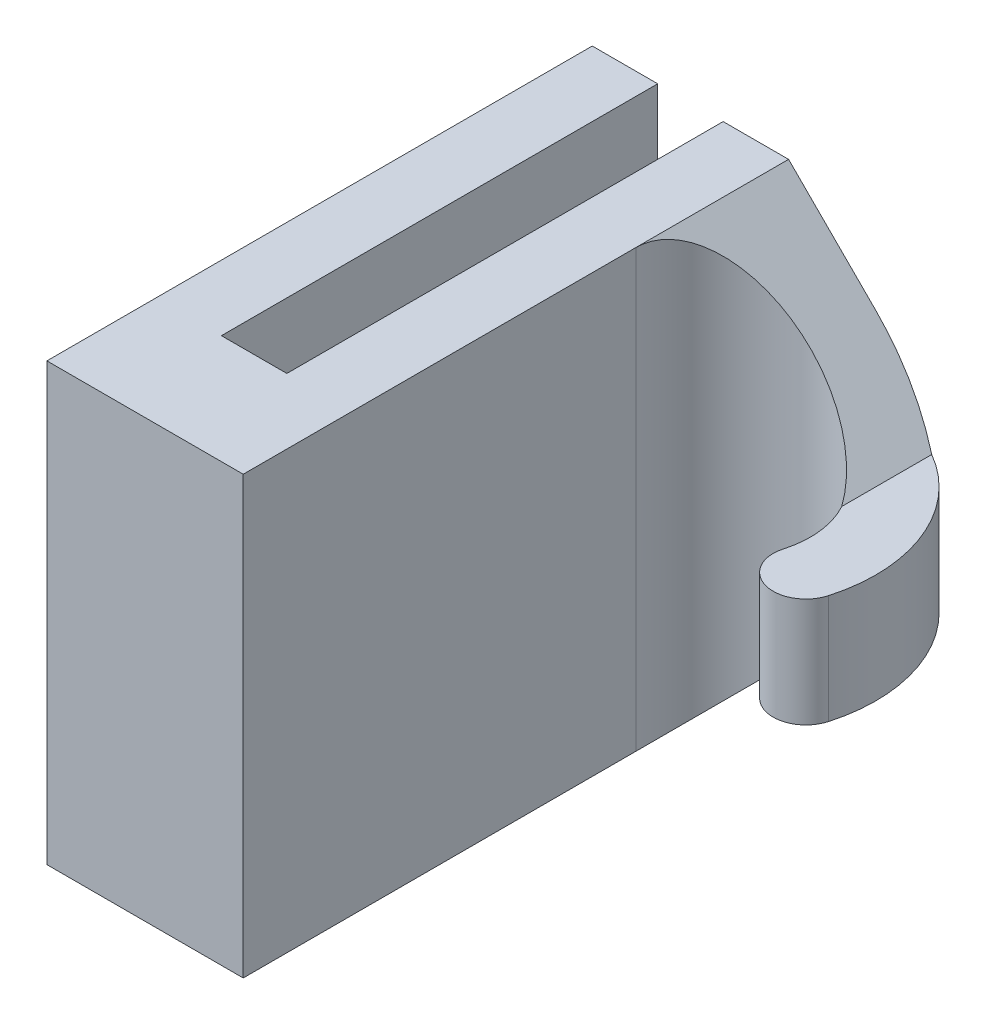
ISO-10303-21;
HEADER;
FILE_DESCRIPTION(('STEP AP214'),'2;1');
FILE_NAME('part.step','',(''),(''),'','','');
FILE_SCHEMA(('AUTOMOTIVE_DESIGN { 1 0 10303 214 1 1 1 1 }'));
ENDSEC;
DATA;
#1=APPLICATION_CONTEXT('core data for automotive mechanical design processes');
#2=APPLICATION_PROTOCOL_DEFINITION('international standard','automotive_design',2000,#1);
#3=PRODUCT_CONTEXT('',#1,'mechanical');
#4=PRODUCT('Part','Part','',(#3));
#5=PRODUCT_RELATED_PRODUCT_CATEGORY('part','',(#4));
#6=PRODUCT_DEFINITION_FORMATION('','',#4);
#7=PRODUCT_DEFINITION_CONTEXT('part definition',#1,'design');
#8=PRODUCT_DEFINITION('design','',#6,#7);
#9=PRODUCT_DEFINITION_SHAPE('','',#8);
#10=(LENGTH_UNIT() NAMED_UNIT(*) SI_UNIT(.MILLI.,.METRE.));
#11=(NAMED_UNIT(*) PLANE_ANGLE_UNIT() SI_UNIT($,.RADIAN.));
#12=(NAMED_UNIT(*) SI_UNIT($,.STERADIAN.) SOLID_ANGLE_UNIT());
#13=UNCERTAINTY_MEASURE_WITH_UNIT(LENGTH_MEASURE(1.E-05),#10,'distance_accuracy_value','');
#14=(GEOMETRIC_REPRESENTATION_CONTEXT(3) GLOBAL_UNCERTAINTY_ASSIGNED_CONTEXT((#13)) GLOBAL_UNIT_ASSIGNED_CONTEXT((#10,
#11,#12)) REPRESENTATION_CONTEXT('',''));
#15=CARTESIAN_POINT('',(0.,0.,0.));
#16=DIRECTION('',(0.,0.,1.));
#17=DIRECTION('',(1.,0.,0.));
#18=AXIS2_PLACEMENT_3D('',#15,#16,#17);
#19=CARTESIAN_POINT('',(0.,123.429339488827,115.));
#20=DIRECTION('',(-1.,0.,0.));
#21=DIRECTION('',(0.,0.,1.));
#22=AXIS2_PLACEMENT_3D('',#19,#20,#21);
#23=PLANE('',#22);
#24=DIRECTION('',(0.,0.,1.));
#25=VECTOR('',#24,1.);
#26=CARTESIAN_POINT('',(0.,150.,115.));
#27=LINE('',#26,#25);
#28=CARTESIAN_POINT('',(0.,150.,95.));
#29=VERTEX_POINT('',#28);
#30=CARTESIAN_POINT('',(0.,150.,115.));
#31=VERTEX_POINT('',#30);
#32=EDGE_CURVE('E231',#29,#31,#27,.T.);
#33=ORIENTED_EDGE('',*,*,#32,.F.);
#34=DIRECTION('',(0.,1.,0.));
#35=VECTOR('',#34,1.);
#36=CARTESIAN_POINT('',(0.,123.429339488827,95.));
#37=LINE('',#36,#35);
#38=CARTESIAN_POINT('',(0.,170.,95.));
#39=VERTEX_POINT('',#38);
#40=EDGE_CURVE('E181',#29,#39,#37,.T.);
#41=ORIENTED_EDGE('',*,*,#40,.T.);
#42=DIRECTION('',(0.,0.,1.));
#43=VECTOR('',#42,1.);
#44=CARTESIAN_POINT('',(0.,170.,115.));
#45=LINE('',#44,#43);
#46=CARTESIAN_POINT('',(0.,170.,115.));
#47=VERTEX_POINT('',#46);
#48=EDGE_CURVE('E215',#39,#47,#45,.T.);
#49=ORIENTED_EDGE('',*,*,#48,.T.);
#50=DIRECTION('',(0.,1.,0.));
#51=VECTOR('',#50,1.);
#52=CARTESIAN_POINT('',(0.,123.429339488827,115.));
#53=LINE('',#52,#51);
#54=EDGE_CURVE('E211',#31,#47,#53,.T.);
#55=ORIENTED_EDGE('',*,*,#54,.F.);
#56=EDGE_LOOP('',(#33,#41,#49,#55));
#57=FACE_BOUND('',#56,.T.);
#58=ADVANCED_FACE('F47',(#57),#23,.F.);
#59=CARTESIAN_POINT('',(3.,123.429339488827,115.));
#60=DIRECTION('',(0.,0.,1.));
#61=DIRECTION('',(1.,0.,0.));
#62=AXIS2_PLACEMENT_3D('',#59,#60,#61);
#63=PLANE('',#62);
#64=DIRECTION('',(1.,0.,0.));
#65=VECTOR('',#64,1.);
#66=CARTESIAN_POINT('',(3.00000000000025,150.,115.));
#67=LINE('',#66,#65);
#68=CARTESIAN_POINT('',(3.,150.,115.));
#69=VERTEX_POINT('',#68);
#70=EDGE_CURVE('E235',#31,#69,#67,.T.);
#71=ORIENTED_EDGE('',*,*,#70,.F.);
#72=ORIENTED_EDGE('',*,*,#54,.T.);
#73=DIRECTION('',(1.,0.,0.));
#74=VECTOR('',#73,1.);
#75=CARTESIAN_POINT('',(3.,170.,115.));
#76=LINE('',#75,#74);
#77=CARTESIAN_POINT('',(3.,170.,115.));
#78=VERTEX_POINT('',#77);
#79=EDGE_CURVE('E208',#47,#78,#76,.T.);
#80=ORIENTED_EDGE('',*,*,#79,.T.);
#81=DIRECTION('',(0.,1.,0.));
#82=VECTOR('',#81,1.);
#83=CARTESIAN_POINT('',(3.,123.429339488827,115.));
#84=LINE('',#83,#82);
#85=EDGE_CURVE('E210',#69,#78,#84,.T.);
#86=ORIENTED_EDGE('',*,*,#85,.F.);
#87=EDGE_LOOP('',(#71,#72,#80,#86));
#88=FACE_BOUND('',#87,.T.);
#89=ADVANCED_FACE('F271',(#88),#63,.F.);
#90=CARTESIAN_POINT('',(3.,123.429339488827,95.));
#91=DIRECTION('',(1.,0.,0.));
#92=DIRECTION('',(0.,0.,-1.));
#93=AXIS2_PLACEMENT_3D('',#90,#91,#92);
#94=PLANE('',#93);
#95=DIRECTION('',(0.,0.,-1.));
#96=VECTOR('',#95,1.);
#97=CARTESIAN_POINT('',(3.,170.,95.));
#98=LINE('',#97,#96);
#99=CARTESIAN_POINT('',(3.,170.,95.));
#100=VERTEX_POINT('',#99);
#101=EDGE_CURVE('E204',#78,#100,#98,.T.);
#102=ORIENTED_EDGE('',*,*,#101,.T.);
#103=DIRECTION('',(0.,1.,0.));
#104=VECTOR('',#103,1.);
#105=CARTESIAN_POINT('',(3.,123.429339488827,95.));
#106=LINE('',#105,#104);
#107=CARTESIAN_POINT('',(3.,150.,95.));
#108=VERTEX_POINT('',#107);
#109=EDGE_CURVE('E201',#108,#100,#106,.T.);
#110=ORIENTED_EDGE('',*,*,#109,.F.);
#111=DIRECTION('',(0.,0.,-1.));
#112=VECTOR('',#111,1.);
#113=CARTESIAN_POINT('',(3.,150.,95.));
#114=LINE('',#113,#112);
#115=EDGE_CURVE('E226',#69,#108,#114,.T.);
#116=ORIENTED_EDGE('',*,*,#115,.F.);
#117=ORIENTED_EDGE('',*,*,#85,.T.);
#118=EDGE_LOOP('',(#102,#110,#116,#117));
#119=FACE_BOUND('',#118,.T.);
#120=ADVANCED_FACE('F267',(#119),#94,.F.);
#121=CARTESIAN_POINT('',(6.,123.429339488827,95.));
#122=DIRECTION('',(0.,0.,1.));
#123=DIRECTION('',(1.,0.,0.));
#124=AXIS2_PLACEMENT_3D('',#121,#122,#123);
#125=PLANE('',#124);
#126=ORIENTED_EDGE('',*,*,#109,.T.);
#127=DIRECTION('',(1.,0.,0.));
#128=VECTOR('',#127,1.);
#129=CARTESIAN_POINT('',(6.,170.,95.));
#130=LINE('',#129,#128);
#131=CARTESIAN_POINT('',(6.,170.,95.));
#132=VERTEX_POINT('',#131);
#133=EDGE_CURVE('E203',#100,#132,#130,.T.);
#134=ORIENTED_EDGE('',*,*,#133,.T.);
#135=DIRECTION('',(-0.707106781186552,0.707106781186543,0.));
#136=VECTOR('',#135,1.);
#137=CARTESIAN_POINT('',(29.2853302555864,146.714669744414,95.));
#138=LINE('',#137,#136);
#139=CARTESIAN_POINT('',(10.,166.,95.));
#140=VERTEX_POINT('',#139);
#141=EDGE_CURVE('E255',#132,#140,#138,.F.);
#142=ORIENTED_EDGE('',*,*,#141,.T.);
#143=DIRECTION('',(0.,1.,0.));
#144=VECTOR('',#143,1.);
#145=CARTESIAN_POINT('',(10.,157.5,95.));
#146=LINE('',#145,#144);
#147=CARTESIAN_POINT('',(10.,154.,95.));
#148=VERTEX_POINT('',#147);
#149=EDGE_CURVE('E61',#148,#140,#146,.T.);
#150=ORIENTED_EDGE('',*,*,#149,.F.);
#151=DIRECTION('',(-0.707106781186543,-0.707106781186552,0.));
#152=VECTOR('',#151,1.);
#153=CARTESIAN_POINT('',(-7.28533025558639,136.714669744413,95.));
#154=LINE('',#153,#152);
#155=CARTESIAN_POINT('',(6.,150.,95.));
#156=VERTEX_POINT('',#155);
#157=EDGE_CURVE('E11',#148,#156,#154,.T.);
#158=ORIENTED_EDGE('',*,*,#157,.T.);
#159=DIRECTION('',(1.,0.,0.));
#160=VECTOR('',#159,1.);
#161=CARTESIAN_POINT('',(6.00000000000025,150.,95.));
#162=LINE('',#161,#160);
#163=EDGE_CURVE('E227',#108,#156,#162,.T.);
#164=ORIENTED_EDGE('',*,*,#163,.F.);
#165=EDGE_LOOP('',(#126,#134,#142,#150,#158,#164));
#166=FACE_BOUND('',#165,.T.);
#167=ADVANCED_FACE('F263',(#166),#125,.F.);
#168=CARTESIAN_POINT('',(6.,123.429339488827,120.));
#169=DIRECTION('',(-1.,0.,0.));
#170=DIRECTION('',(0.,0.,1.));
#171=AXIS2_PLACEMENT_3D('',#168,#169,#170);
#172=PLANE('',#171);
#173=DIRECTION('',(0.,1.,0.));
#174=VECTOR('',#173,1.);
#175=CARTESIAN_POINT('',(6.,157.5,102.));
#176=LINE('',#175,#174);
#177=CARTESIAN_POINT('',(6.,150.,102.));
#178=VERTEX_POINT('',#177);
#179=CARTESIAN_POINT('',(6.,170.,102.));
#180=VERTEX_POINT('',#179);
#181=EDGE_CURVE('E175',#178,#180,#176,.T.);
#182=ORIENTED_EDGE('',*,*,#181,.T.);
#183=DIRECTION('',(0.,0.,1.));
#184=VECTOR('',#183,1.);
#185=CARTESIAN_POINT('',(6.,170.,120.));
#186=LINE('',#185,#184);
#187=CARTESIAN_POINT('',(6.,170.,120.));
#188=VERTEX_POINT('',#187);
#189=EDGE_CURVE('E199',#180,#188,#186,.T.);
#190=ORIENTED_EDGE('',*,*,#189,.T.);
#191=DIRECTION('',(0.,1.,0.));
#192=VECTOR('',#191,1.);
#193=CARTESIAN_POINT('',(6.,123.429339488827,120.));
#194=LINE('',#193,#192);
#195=CARTESIAN_POINT('',(6.,150.,120.));
#196=VERTEX_POINT('',#195);
#197=EDGE_CURVE('E198',#196,#188,#194,.T.);
#198=ORIENTED_EDGE('',*,*,#197,.F.);
#199=DIRECTION('',(0.,0.,1.));
#200=VECTOR('',#199,1.);
#201=CARTESIAN_POINT('',(6.,150.,120.));
#202=LINE('',#201,#200);
#203=EDGE_CURVE('E223',#178,#196,#202,.T.);
#204=ORIENTED_EDGE('',*,*,#203,.F.);
#205=EDGE_LOOP('',(#182,#190,#198,#204));
#206=FACE_BOUND('',#205,.T.);
#207=ADVANCED_FACE('F294',(#206),#172,.F.);
#208=CARTESIAN_POINT('',(-3.,123.429339488827,120.));
#209=DIRECTION('',(0.,0.,-1.));
#210=DIRECTION('',(-1.,0.,0.));
#211=AXIS2_PLACEMENT_3D('',#208,#209,#210);
#212=PLANE('',#211);
#213=DIRECTION('',(-1.,0.,0.));
#214=VECTOR('',#213,1.);
#215=CARTESIAN_POINT('',(-2.99999999999975,150.,120.));
#216=LINE('',#215,#214);
#217=CARTESIAN_POINT('',(-3.,150.,120.));
#218=VERTEX_POINT('',#217);
#219=EDGE_CURVE('E218',#196,#218,#216,.T.);
#220=ORIENTED_EDGE('',*,*,#219,.F.);
#221=ORIENTED_EDGE('',*,*,#197,.T.);
#222=DIRECTION('',(-1.,0.,0.));
#223=VECTOR('',#222,1.);
#224=CARTESIAN_POINT('',(-3.,170.,120.));
#225=LINE('',#224,#223);
#226=CARTESIAN_POINT('',(-3.,170.,120.));
#227=VERTEX_POINT('',#226);
#228=EDGE_CURVE('E193',#188,#227,#225,.T.);
#229=ORIENTED_EDGE('',*,*,#228,.T.);
#230=DIRECTION('',(0.,1.,0.));
#231=VECTOR('',#230,1.);
#232=CARTESIAN_POINT('',(-3.,123.429339488827,120.));
#233=LINE('',#232,#231);
#234=EDGE_CURVE('E195',#218,#227,#233,.T.);
#235=ORIENTED_EDGE('',*,*,#234,.F.);
#236=EDGE_LOOP('',(#220,#221,#229,#235));
#237=FACE_BOUND('',#236,.T.);
#238=ADVANCED_FACE('F299',(#237),#212,.F.);
#239=CARTESIAN_POINT('',(-3.,123.429339488827,95.));
#240=DIRECTION('',(1.,0.,0.));
#241=DIRECTION('',(0.,0.,-1.));
#242=AXIS2_PLACEMENT_3D('',#239,#240,#241);
#243=PLANE('',#242);
#244=DIRECTION('',(0.,0.,-1.));
#245=VECTOR('',#244,1.);
#246=CARTESIAN_POINT('',(-3.,150.,95.));
#247=LINE('',#246,#245);
#248=CARTESIAN_POINT('',(-3.,150.,95.));
#249=VERTEX_POINT('',#248);
#250=EDGE_CURVE('E214',#218,#249,#247,.T.);
#251=ORIENTED_EDGE('',*,*,#250,.F.);
#252=ORIENTED_EDGE('',*,*,#234,.T.);
#253=DIRECTION('',(0.,0.,-1.));
#254=VECTOR('',#253,1.);
#255=CARTESIAN_POINT('',(-3.,170.,95.));
#256=LINE('',#255,#254);
#257=CARTESIAN_POINT('',(-3.,170.,95.));
#258=VERTEX_POINT('',#257);
#259=EDGE_CURVE('E186',#227,#258,#256,.T.);
#260=ORIENTED_EDGE('',*,*,#259,.T.);
#261=DIRECTION('',(0.,1.,0.));
#262=VECTOR('',#261,1.);
#263=CARTESIAN_POINT('',(-3.,123.429339488827,95.));
#264=LINE('',#263,#262);
#265=EDGE_CURVE('E189',#249,#258,#264,.T.);
#266=ORIENTED_EDGE('',*,*,#265,.F.);
#267=EDGE_LOOP('',(#251,#252,#260,#266));
#268=FACE_BOUND('',#267,.T.);
#269=ADVANCED_FACE('F305',(#268),#243,.F.);
#270=CARTESIAN_POINT('',(0.,123.429339488827,95.));
#271=DIRECTION('',(0.,0.,1.));
#272=DIRECTION('',(1.,0.,0.));
#273=AXIS2_PLACEMENT_3D('',#270,#271,#272);
#274=PLANE('',#273);
#275=DIRECTION('',(1.,0.,0.));
#276=VECTOR('',#275,1.);
#277=CARTESIAN_POINT('',(2.45827992325021E-13,150.,95.));
#278=LINE('',#277,#276);
#279=EDGE_CURVE('E190',#249,#29,#278,.T.);
#280=ORIENTED_EDGE('',*,*,#279,.F.);
#281=ORIENTED_EDGE('',*,*,#265,.T.);
#282=DIRECTION('',(1.,0.,0.));
#283=VECTOR('',#282,1.);
#284=CARTESIAN_POINT('',(0.,170.,95.));
#285=LINE('',#284,#283);
#286=EDGE_CURVE('E184',#258,#39,#285,.T.);
#287=ORIENTED_EDGE('',*,*,#286,.T.);
#288=ORIENTED_EDGE('',*,*,#40,.F.);
#289=EDGE_LOOP('',(#280,#281,#287,#288));
#290=FACE_BOUND('',#289,.T.);
#291=ADVANCED_FACE('F307',(#290),#274,.F.);
#292=CARTESIAN_POINT('',(0.,170.,0.));
#293=DIRECTION('',(0.,1.,0.));
#294=DIRECTION('',(0.,0.,1.));
#295=AXIS2_PLACEMENT_3D('',#292,#293,#294);
#296=PLANE('',#295);
#297=ORIENTED_EDGE('',*,*,#48,.F.);
#298=ORIENTED_EDGE('',*,*,#286,.F.);
#299=ORIENTED_EDGE('',*,*,#259,.F.);
#300=ORIENTED_EDGE('',*,*,#228,.F.);
#301=ORIENTED_EDGE('',*,*,#189,.F.);
#302=EDGE_CURVE('E197',#132,#180,#186,.T.);
#303=ORIENTED_EDGE('',*,*,#302,.F.);
#304=ORIENTED_EDGE('',*,*,#133,.F.);
#305=ORIENTED_EDGE('',*,*,#101,.F.);
#306=ORIENTED_EDGE('',*,*,#79,.F.);
#307=EDGE_LOOP('',(#297,#298,#299,#300,#301,#303,#304,#305,#306));
#308=FACE_BOUND('',#307,.T.);
#309=ADVANCED_FACE('F279',(#308),#296,.T.);
#310=CARTESIAN_POINT('',(0.,150.,115.));
#311=DIRECTION('',(0.,-1.,0.));
#312=DIRECTION('',(1.,0.,0.));
#313=AXIS2_PLACEMENT_3D('',#310,#311,#312);
#314=PLANE('',#313);
#315=ORIENTED_EDGE('',*,*,#279,.T.);
#316=ORIENTED_EDGE('',*,*,#32,.T.);
#317=ORIENTED_EDGE('',*,*,#70,.T.);
#318=ORIENTED_EDGE('',*,*,#115,.T.);
#319=ORIENTED_EDGE('',*,*,#163,.T.);
#320=EDGE_CURVE('E225',#156,#178,#202,.T.);
#321=ORIENTED_EDGE('',*,*,#320,.T.);
#322=ORIENTED_EDGE('',*,*,#203,.T.);
#323=ORIENTED_EDGE('',*,*,#219,.T.);
#324=ORIENTED_EDGE('',*,*,#250,.T.);
#325=EDGE_LOOP('',(#315,#316,#317,#318,#319,#321,#322,#323,#324));
#326=FACE_BOUND('',#325,.T.);
#327=ADVANCED_FACE('F266',(#326),#314,.T.);
#328=CARTESIAN_POINT('',(10.,157.5,102.));
#329=DIRECTION('',(0.,-1.,0.));
#330=DIRECTION('',(0.,0.,-1.));
#331=AXIS2_PLACEMENT_3D('',#328,#329,#330);
#332=PLANE('',#331);
#333=CARTESIAN_POINT('',(10.,157.5,102.));
#334=DIRECTION('',(0.,1.,0.));
#335=DIRECTION('',(0.,0.,-1.));
#336=AXIS2_PLACEMENT_3D('',#333,#334,#335);
#337=CIRCLE('',#336,4.);
#338=CARTESIAN_POINT('',(13.8483655433667,157.5,103.090909090909));
#339=VERTEX_POINT('',#338);
#340=CARTESIAN_POINT('',(13.5,157.5,100.063508326896));
#341=VERTEX_POINT('',#340);
#342=EDGE_CURVE('E168',#339,#341,#337,.T.);
#343=ORIENTED_EDGE('',*,*,#342,.T.);
#344=DIRECTION('',(0.,0.,-1.));
#345=VECTOR('',#344,1.);
#346=CARTESIAN_POINT('',(13.5,157.5,102.));
#347=LINE('',#346,#345);
#348=CARTESIAN_POINT('',(13.5,157.5,95.9378221735089));
#349=VERTEX_POINT('',#348);
#350=EDGE_CURVE('E152',#341,#349,#347,.T.);
#351=ORIENTED_EDGE('',*,*,#350,.T.);
#352=CARTESIAN_POINT('',(10.,157.5,102.));
#353=DIRECTION('',(0.,-1.,0.));
#354=DIRECTION('',(0.,0.,-1.));
#355=AXIS2_PLACEMENT_3D('',#352,#353,#354);
#356=CIRCLE('',#355,6.99999999999999);
#357=CARTESIAN_POINT('',(16.7346397008917,157.5,103.909090909091));
#358=VERTEX_POINT('',#357);
#359=EDGE_CURVE('E148',#349,#358,#356,.T.);
#360=ORIENTED_EDGE('',*,*,#359,.T.);
#361=CARTESIAN_POINT('',(15.2915026221292,157.5,103.5));
#362=DIRECTION('',(0.,-1.,0.));
#363=DIRECTION('',(0.,0.,1.));
#364=AXIS2_PLACEMENT_3D('',#361,#362,#363);
#365=CIRCLE('',#364,1.5);
#366=EDGE_CURVE('E151',#358,#339,#365,.T.);
#367=ORIENTED_EDGE('',*,*,#366,.T.);
#368=EDGE_LOOP('',(#343,#351,#360,#367));
#369=FACE_BOUND('',#368,.T.);
#370=ADVANCED_FACE('F149',(#369),#332,.T.);
#371=CARTESIAN_POINT('',(10.,162.5,102.));
#372=DIRECTION('',(0.,-1.,0.));
#373=DIRECTION('',(0.,0.,-1.));
#374=AXIS2_PLACEMENT_3D('',#371,#372,#373);
#375=PLANE('',#374);
#376=CARTESIAN_POINT('',(10.,162.5,102.));
#377=DIRECTION('',(0.,-1.,0.));
#378=DIRECTION('',(0.,0.,-1.));
#379=AXIS2_PLACEMENT_3D('',#376,#377,#378);
#380=CIRCLE('',#379,6.99999999999999);
#381=CARTESIAN_POINT('',(13.5,162.5,95.937822173509));
#382=VERTEX_POINT('',#381);
#383=CARTESIAN_POINT('',(16.7346397008917,162.5,103.909090909091));
#384=VERTEX_POINT('',#383);
#385=EDGE_CURVE('E165',#382,#384,#380,.T.);
#386=ORIENTED_EDGE('',*,*,#385,.F.);
#387=DIRECTION('',(0.,0.,1.));
#388=VECTOR('',#387,1.);
#389=CARTESIAN_POINT('',(13.5,162.5,102.));
#390=LINE('',#389,#388);
#391=CARTESIAN_POINT('',(13.5,162.5,100.063508326896));
#392=VERTEX_POINT('',#391);
#393=EDGE_CURVE('E217',#382,#392,#390,.T.);
#394=ORIENTED_EDGE('',*,*,#393,.T.);
#395=CARTESIAN_POINT('',(10.,162.5,102.));
#396=DIRECTION('',(0.,1.,0.));
#397=DIRECTION('',(0.,0.,-1.));
#398=AXIS2_PLACEMENT_3D('',#395,#396,#397);
#399=CIRCLE('',#398,4.);
#400=CARTESIAN_POINT('',(13.8483655433667,162.5,103.090909090909));
#401=VERTEX_POINT('',#400);
#402=EDGE_CURVE('E156',#401,#392,#399,.T.);
#403=ORIENTED_EDGE('',*,*,#402,.F.);
#404=CARTESIAN_POINT('',(15.2915026221292,162.5,103.5));
#405=DIRECTION('',(0.,-1.,0.));
#406=DIRECTION('',(0.,0.,1.));
#407=AXIS2_PLACEMENT_3D('',#404,#405,#406);
#408=CIRCLE('',#407,1.5);
#409=EDGE_CURVE('E177',#384,#401,#408,.T.);
#410=ORIENTED_EDGE('',*,*,#409,.F.);
#411=EDGE_LOOP('',(#386,#394,#403,#410));
#412=FACE_BOUND('',#411,.T.);
#413=ADVANCED_FACE('F290',(#412),#375,.F.);
#414=CARTESIAN_POINT('',(10.,157.5,102.));
#415=DIRECTION('',(0.,1.,0.));
#416=DIRECTION('',(0.,0.,1.));
#417=AXIS2_PLACEMENT_3D('',#414,#415,#416);
#418=CYLINDRICAL_SURFACE('',#417,6.99999999999999);
#419=ORIENTED_EDGE('',*,*,#149,.T.);
#420=CARTESIAN_POINT('',(10.,166.,102.));
#421=DIRECTION('',(0.707106781186543,0.707106781186552,0.));
#422=DIRECTION('',(-0.707106781186552,0.707106781186543,0.));
#423=AXIS2_PLACEMENT_3D('',#420,#421,#422);
#424=ELLIPSE('',#423,9.8994949366116,6.99999999999999);
#425=EDGE_CURVE('E258',#140,#382,#424,.F.);
#426=ORIENTED_EDGE('',*,*,#425,.T.);
#427=ORIENTED_EDGE('',*,*,#385,.T.);
#428=DIRECTION('',(0.,1.,0.));
#429=VECTOR('',#428,1.);
#430=CARTESIAN_POINT('',(16.7346397008917,157.5,103.909090909091));
#431=LINE('',#430,#429);
#432=EDGE_CURVE('E157',#358,#384,#431,.T.);
#433=ORIENTED_EDGE('',*,*,#432,.F.);
#434=ORIENTED_EDGE('',*,*,#359,.F.);
#435=CARTESIAN_POINT('',(10.,154.,102.));
#436=DIRECTION('',(-0.707106781186552,0.707106781186543,0.));
#437=DIRECTION('',(0.707106781186543,0.707106781186552,0.));
#438=AXIS2_PLACEMENT_3D('',#435,#436,#437);
#439=ELLIPSE('',#438,9.89949493661172,6.99999999999999);
#440=EDGE_CURVE('E59',#349,#148,#439,.T.);
#441=ORIENTED_EDGE('',*,*,#440,.T.);
#442=EDGE_LOOP('',(#419,#426,#427,#433,#434,#441));
#443=FACE_BOUND('',#442,.T.);
#444=ADVANCED_FACE('F159',(#443),#418,.T.);
#445=CARTESIAN_POINT('',(15.2915026221292,157.5,103.5));
#446=DIRECTION('',(0.,1.,0.));
#447=DIRECTION('',(0.,0.,1.));
#448=AXIS2_PLACEMENT_3D('',#445,#446,#447);
#449=CYLINDRICAL_SURFACE('',#448,1.5);
#450=ORIENTED_EDGE('',*,*,#409,.T.);
#451=DIRECTION('',(0.,1.,0.));
#452=VECTOR('',#451,1.);
#453=CARTESIAN_POINT('',(13.8483655433667,157.5,103.090909090909));
#454=LINE('',#453,#452);
#455=EDGE_CURVE('E164',#339,#401,#454,.T.);
#456=ORIENTED_EDGE('',*,*,#455,.F.);
#457=ORIENTED_EDGE('',*,*,#366,.F.);
#458=ORIENTED_EDGE('',*,*,#432,.T.);
#459=EDGE_LOOP('',(#450,#456,#457,#458));
#460=FACE_BOUND('',#459,.T.);
#461=ADVANCED_FACE('F170',(#460),#449,.T.);
#462=CARTESIAN_POINT('',(10.,157.5,102.));
#463=DIRECTION('',(0.,1.,0.));
#464=DIRECTION('',(0.,0.,1.));
#465=AXIS2_PLACEMENT_3D('',#462,#463,#464);
#466=CYLINDRICAL_SURFACE('',#465,4.);
#467=ORIENTED_EDGE('',*,*,#402,.T.);
#468=CARTESIAN_POINT('',(10.,166.,102.));
#469=DIRECTION('',(0.707106781186543,0.707106781186552,0.));
#470=DIRECTION('',(-0.707106781186552,0.707106781186543,0.));
#471=AXIS2_PLACEMENT_3D('',#468,#469,#470);
#472=ELLIPSE('',#471,5.65685424949234,4.);
#473=EDGE_CURVE('E253',#392,#180,#472,.T.);
#474=ORIENTED_EDGE('',*,*,#473,.T.);
#475=ORIENTED_EDGE('',*,*,#181,.F.);
#476=CARTESIAN_POINT('',(10.,154.,102.));
#477=DIRECTION('',(-0.707106781186552,0.707106781186543,0.));
#478=DIRECTION('',(0.707106781186543,0.707106781186552,0.));
#479=AXIS2_PLACEMENT_3D('',#476,#477,#478);
#480=ELLIPSE('',#479,5.65685424949241,4.);
#481=EDGE_CURVE('E256',#178,#341,#480,.F.);
#482=ORIENTED_EDGE('',*,*,#481,.T.);
#483=ORIENTED_EDGE('',*,*,#342,.F.);
#484=ORIENTED_EDGE('',*,*,#455,.T.);
#485=EDGE_LOOP('',(#467,#474,#475,#482,#483,#484));
#486=FACE_BOUND('',#485,.T.);
#487=ADVANCED_FACE('F286',(#486),#466,.F.);
#488=CARTESIAN_POINT('',(13.5,162.5,102.));
#489=DIRECTION('',(0.707106781186543,0.707106781186552,0.));
#490=DIRECTION('',(0.,0.,-1.));
#491=AXIS2_PLACEMENT_3D('',#488,#489,#490);
#492=PLANE('',#491);
#493=ORIENTED_EDGE('',*,*,#141,.F.);
#494=ORIENTED_EDGE('',*,*,#302,.T.);
#495=ORIENTED_EDGE('',*,*,#473,.F.);
#496=ORIENTED_EDGE('',*,*,#393,.F.);
#497=ORIENTED_EDGE('',*,*,#425,.F.);
#498=EDGE_LOOP('',(#493,#494,#495,#496,#497));
#499=FACE_BOUND('',#498,.T.);
#500=ADVANCED_FACE('F283',(#499),#492,.T.);
#501=CARTESIAN_POINT('',(6.,150.,120.));
#502=DIRECTION('',(-0.707106781186552,0.707106781186543,0.));
#503=DIRECTION('',(0.,0.,1.));
#504=AXIS2_PLACEMENT_3D('',#501,#502,#503);
#505=PLANE('',#504);
#506=ORIENTED_EDGE('',*,*,#440,.F.);
#507=ORIENTED_EDGE('',*,*,#350,.F.);
#508=ORIENTED_EDGE('',*,*,#481,.F.);
#509=ORIENTED_EDGE('',*,*,#320,.F.);
#510=ORIENTED_EDGE('',*,*,#157,.F.);
#511=EDGE_LOOP('',(#506,#507,#508,#509,#510));
#512=FACE_BOUND('',#511,.T.);
#513=ADVANCED_FACE('F55',(#512),#505,.F.);
#514=CLOSED_SHELL('',(#58,#89,#120,#167,#207,#238,#269,#291,#309,#327,#370,#413,#444,#461,#487,
#500,#513));
#515=MANIFOLD_SOLID_BREP('B2',#514);
#516=ADVANCED_BREP_SHAPE_REPRESENTATION('',(#18,#515),#14);
#517=SHAPE_DEFINITION_REPRESENTATION(#9,#516);
ENDSEC;
END-ISO-10303-21;
